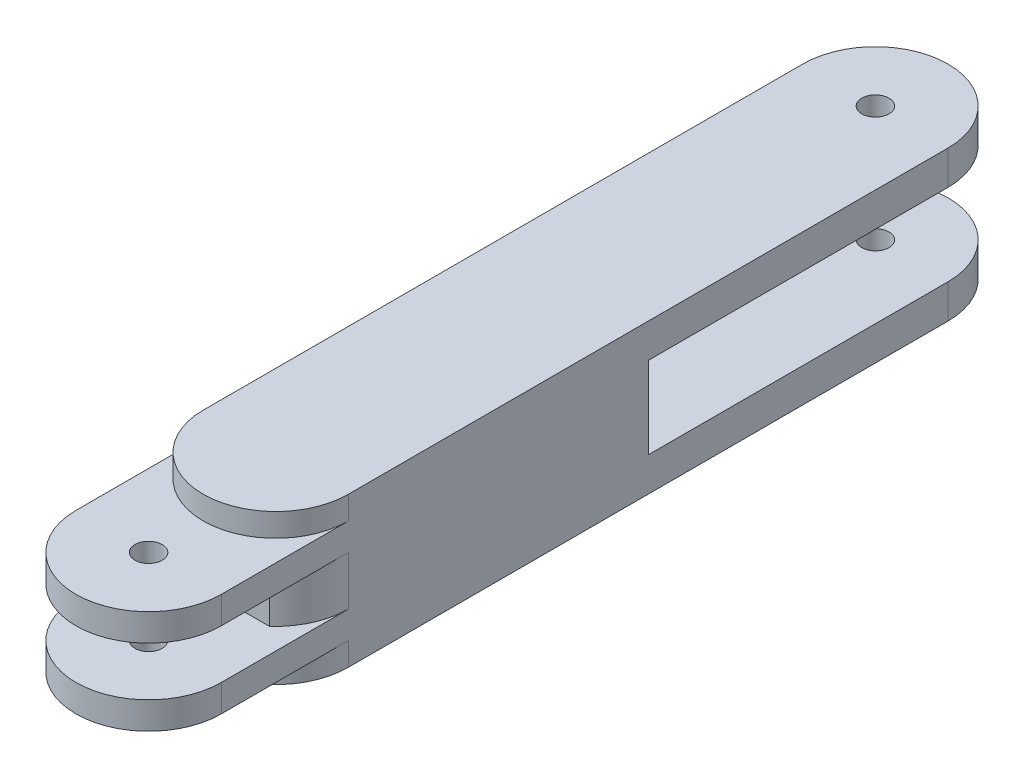
ISO-10303-21;
HEADER;
FILE_DESCRIPTION(('STEP AP214'),'2;1');
FILE_NAME('part.step','',(''),(''),'','','');
FILE_SCHEMA(('AUTOMOTIVE_DESIGN { 1 0 10303 214 1 1 1 1 }'));
ENDSEC;
DATA;
#1=APPLICATION_CONTEXT('core data for automotive mechanical design processes');
#2=APPLICATION_PROTOCOL_DEFINITION('international standard','automotive_design',2000,#1);
#3=PRODUCT_CONTEXT('',#1,'mechanical');
#4=PRODUCT('Part','Part','',(#3));
#5=PRODUCT_RELATED_PRODUCT_CATEGORY('part','',(#4));
#6=PRODUCT_DEFINITION_FORMATION('','',#4);
#7=PRODUCT_DEFINITION_CONTEXT('part definition',#1,'design');
#8=PRODUCT_DEFINITION('design','',#6,#7);
#9=PRODUCT_DEFINITION_SHAPE('','',#8);
#10=(LENGTH_UNIT() NAMED_UNIT(*) SI_UNIT(.MILLI.,.METRE.));
#11=(NAMED_UNIT(*) PLANE_ANGLE_UNIT() SI_UNIT($,.RADIAN.));
#12=(NAMED_UNIT(*) SI_UNIT($,.STERADIAN.) SOLID_ANGLE_UNIT());
#13=UNCERTAINTY_MEASURE_WITH_UNIT(LENGTH_MEASURE(1.E-05),#10,'distance_accuracy_value','');
#14=(GEOMETRIC_REPRESENTATION_CONTEXT(3) GLOBAL_UNCERTAINTY_ASSIGNED_CONTEXT((#13)) GLOBAL_UNIT_ASSIGNED_CONTEXT((#10,
#11,#12)) REPRESENTATION_CONTEXT('',''));
#15=CARTESIAN_POINT('',(0.,0.,0.));
#16=DIRECTION('',(0.,0.,1.));
#17=DIRECTION('',(1.,0.,0.));
#18=AXIS2_PLACEMENT_3D('',#15,#16,#17);
#19=CARTESIAN_POINT('',(425.80071629813,22.5,165.));
#20=DIRECTION('',(0.,0.,-1.));
#21=DIRECTION('',(-1.,0.,0.));
#22=AXIS2_PLACEMENT_3D('',#19,#20,#21);
#23=PLANE('',#22);
#24=DIRECTION('',(-1.,0.,0.));
#25=VECTOR('',#24,1.);
#26=CARTESIAN_POINT('',(425.80071629813,22.5,165.));
#27=LINE('',#26,#25);
#28=CARTESIAN_POINT('',(-30.,22.5,165.));
#29=VERTEX_POINT('',#28);
#30=CARTESIAN_POINT('',(-40.,22.5,165.));
#31=VERTEX_POINT('',#30);
#32=EDGE_CURVE('E394',#29,#31,#27,.T.);
#33=ORIENTED_EDGE('',*,*,#32,.F.);
#34=DIRECTION('',(0.,-1.,0.));
#35=VECTOR('',#34,1.);
#36=CARTESIAN_POINT('',(-30.,22.5,165.));
#37=LINE('',#36,#35);
#38=CARTESIAN_POINT('',(-30.,-22.5,165.));
#39=VERTEX_POINT('',#38);
#40=EDGE_CURVE('E63',#29,#39,#37,.T.);
#41=ORIENTED_EDGE('',*,*,#40,.T.);
#42=DIRECTION('',(-1.,0.,0.));
#43=VECTOR('',#42,1.);
#44=CARTESIAN_POINT('',(425.80071629813,-22.5,165.));
#45=LINE('',#44,#43);
#46=CARTESIAN_POINT('',(-40.,-22.5,165.));
#47=VERTEX_POINT('',#46);
#48=EDGE_CURVE('E390',#39,#47,#45,.T.);
#49=ORIENTED_EDGE('',*,*,#48,.T.);
#50=DIRECTION('',(0.,-1.,0.));
#51=VECTOR('',#50,1.);
#52=CARTESIAN_POINT('',(-40.,-41.25,165.));
#53=LINE('',#52,#51);
#54=EDGE_CURVE('E384',#31,#47,#53,.T.);
#55=ORIENTED_EDGE('',*,*,#54,.F.);
#56=EDGE_LOOP('',(#33,#41,#49,#55));
#57=FACE_BOUND('',#56,.T.);
#58=ADVANCED_FACE('F54',(#57),#23,.T.);
#59=CARTESIAN_POINT('',(0.,-41.25,330.));
#60=DIRECTION('',(0.,1.,0.));
#61=DIRECTION('',(0.,0.,1.));
#62=AXIS2_PLACEMENT_3D('',#59,#60,#61);
#63=CYLINDRICAL_SURFACE('',#62,40.);
#64=CARTESIAN_POINT('',(0.,28.5,330.));
#65=DIRECTION('',(0.,-1.,0.));
#66=DIRECTION('',(0.,0.,-1.));
#67=AXIS2_PLACEMENT_3D('',#64,#65,#66);
#68=CIRCLE('',#67,40.);
#69=CARTESIAN_POINT('',(40.,28.5,330.));
#70=VERTEX_POINT('',#69);
#71=CARTESIAN_POINT('',(-40.,28.5,330.));
#72=VERTEX_POINT('',#71);
#73=EDGE_CURVE('E343',#70,#72,#68,.T.);
#74=ORIENTED_EDGE('',*,*,#73,.F.);
#75=DIRECTION('',(0.,1.,0.));
#76=VECTOR('',#75,1.);
#77=CARTESIAN_POINT('',(40.,-41.25,330.));
#78=LINE('',#77,#76);
#79=CARTESIAN_POINT('',(40.,41.25,330.));
#80=VERTEX_POINT('',#79);
#81=EDGE_CURVE('E437',#70,#80,#78,.T.);
#82=ORIENTED_EDGE('',*,*,#81,.T.);
#83=CARTESIAN_POINT('',(0.,41.25,330.));
#84=DIRECTION('',(0.,-1.,0.));
#85=DIRECTION('',(1.,0.,0.));
#86=AXIS2_PLACEMENT_3D('',#83,#84,#85);
#87=CIRCLE('',#86,40.);
#88=CARTESIAN_POINT('',(-40.,41.25,330.));
#89=VERTEX_POINT('',#88);
#90=EDGE_CURVE('E420',#80,#89,#87,.T.);
#91=ORIENTED_EDGE('',*,*,#90,.T.);
#92=DIRECTION('',(0.,1.,0.));
#93=VECTOR('',#92,1.);
#94=CARTESIAN_POINT('',(-40.,-41.25,330.));
#95=LINE('',#94,#93);
#96=EDGE_CURVE('E433',#72,#89,#95,.T.);
#97=ORIENTED_EDGE('',*,*,#96,.F.);
#98=EDGE_LOOP('',(#74,#82,#91,#97));
#99=FACE_BOUND('',#98,.T.);
#100=ADVANCED_FACE('F514',(#99),#63,.T.);
#101=CARTESIAN_POINT('',(40.,-13.5,330.));
#102=VERTEX_POINT('',#101);
#103=CARTESIAN_POINT('',(40.,13.5,330.));
#104=VERTEX_POINT('',#103);
#105=EDGE_CURVE('E442',#102,#104,#78,.T.);
#106=ORIENTED_EDGE('',*,*,#105,.T.);
#107=CARTESIAN_POINT('',(0.,13.5,330.));
#108=DIRECTION('',(0.,-1.,0.));
#109=DIRECTION('',(0.,0.,-1.));
#110=AXIS2_PLACEMENT_3D('',#107,#108,#109);
#111=CIRCLE('',#110,40.);
#112=CARTESIAN_POINT('',(26.457513110646,13.5,360.));
#113=VERTEX_POINT('',#112);
#114=EDGE_CURVE('E342',#104,#113,#111,.T.);
#115=ORIENTED_EDGE('',*,*,#114,.T.);
#116=DIRECTION('',(0.,1.,0.));
#117=VECTOR('',#116,1.);
#118=CARTESIAN_POINT('',(26.4575131106459,-41.25,360.));
#119=LINE('',#118,#117);
#120=CARTESIAN_POINT('',(26.4575131106459,-13.5,360.));
#121=VERTEX_POINT('',#120);
#122=EDGE_CURVE('E451',#113,#121,#119,.F.);
#123=ORIENTED_EDGE('',*,*,#122,.T.);
#124=CARTESIAN_POINT('',(0.,-13.5,330.));
#125=DIRECTION('',(0.,1.,0.));
#126=DIRECTION('',(0.,0.,1.));
#127=AXIS2_PLACEMENT_3D('',#124,#125,#126);
#128=CIRCLE('',#127,40.);
#129=EDGE_CURVE('E371',#121,#102,#128,.T.);
#130=ORIENTED_EDGE('',*,*,#129,.T.);
#131=EDGE_LOOP('',(#106,#115,#123,#130));
#132=FACE_BOUND('',#131,.T.);
#133=ADVANCED_FACE('F517',(#132),#63,.T.);
#134=CARTESIAN_POINT('',(0.,-28.5,330.));
#135=DIRECTION('',(0.,1.,0.));
#136=DIRECTION('',(0.,0.,1.));
#137=AXIS2_PLACEMENT_3D('',#134,#135,#136);
#138=CIRCLE('',#137,40.);
#139=CARTESIAN_POINT('',(-40.,-28.5,330.));
#140=VERTEX_POINT('',#139);
#141=CARTESIAN_POINT('',(40.,-28.5,330.));
#142=VERTEX_POINT('',#141);
#143=EDGE_CURVE('E58',#140,#142,#138,.T.);
#144=ORIENTED_EDGE('',*,*,#143,.F.);
#145=CARTESIAN_POINT('',(-40.,-41.25,330.));
#146=VERTEX_POINT('',#145);
#147=EDGE_CURVE('E434',#146,#140,#95,.T.);
#148=ORIENTED_EDGE('',*,*,#147,.F.);
#149=CARTESIAN_POINT('',(0.,-41.25,330.));
#150=DIRECTION('',(0.,-1.,0.));
#151=DIRECTION('',(1.,0.,0.));
#152=AXIS2_PLACEMENT_3D('',#149,#150,#151);
#153=CIRCLE('',#152,40.);
#154=CARTESIAN_POINT('',(40.,-41.25,330.));
#155=VERTEX_POINT('',#154);
#156=EDGE_CURVE('E407',#155,#146,#153,.T.);
#157=ORIENTED_EDGE('',*,*,#156,.F.);
#158=EDGE_CURVE('E439',#155,#142,#78,.T.);
#159=ORIENTED_EDGE('',*,*,#158,.T.);
#160=EDGE_LOOP('',(#144,#148,#157,#159));
#161=FACE_BOUND('',#160,.T.);
#162=ADVANCED_FACE('F533',(#161),#63,.T.);
#163=DIRECTION('',(0.,1.,0.));
#164=VECTOR('',#163,1.);
#165=CARTESIAN_POINT('',(-26.4575131106459,-41.25,360.));
#166=LINE('',#165,#164);
#167=CARTESIAN_POINT('',(-26.457513110646,13.5,360.));
#168=VERTEX_POINT('',#167);
#169=CARTESIAN_POINT('',(-26.457513110646,-13.5,360.));
#170=VERTEX_POINT('',#169);
#171=EDGE_CURVE('E373',#168,#170,#166,.F.);
#172=ORIENTED_EDGE('',*,*,#171,.F.);
#173=CARTESIAN_POINT('',(-40.,13.5,330.));
#174=VERTEX_POINT('',#173);
#175=EDGE_CURVE('E340',#168,#174,#111,.T.);
#176=ORIENTED_EDGE('',*,*,#175,.T.);
#177=CARTESIAN_POINT('',(-40.,-13.5,330.));
#178=VERTEX_POINT('',#177);
#179=EDGE_CURVE('E438',#178,#174,#95,.T.);
#180=ORIENTED_EDGE('',*,*,#179,.F.);
#181=EDGE_CURVE('E370',#178,#170,#128,.T.);
#182=ORIENTED_EDGE('',*,*,#181,.T.);
#183=EDGE_LOOP('',(#172,#176,#180,#182));
#184=FACE_BOUND('',#183,.T.);
#185=ADVANCED_FACE('F553',(#184),#63,.T.);
#186=CARTESIAN_POINT('',(0.,-41.25,0.));
#187=DIRECTION('',(0.,1.,0.));
#188=DIRECTION('',(0.,0.,1.));
#189=AXIS2_PLACEMENT_3D('',#186,#187,#188);
#190=CYLINDRICAL_SURFACE('',#189,40.);
#191=CARTESIAN_POINT('',(0.,22.5,0.));
#192=DIRECTION('',(0.,-1.,0.));
#193=DIRECTION('',(0.,0.,-1.));
#194=AXIS2_PLACEMENT_3D('',#191,#192,#193);
#195=CIRCLE('',#194,40.);
#196=CARTESIAN_POINT('',(-40.,22.5,0.));
#197=VERTEX_POINT('',#196);
#198=CARTESIAN_POINT('',(40.,22.5,0.));
#199=VERTEX_POINT('',#198);
#200=EDGE_CURVE('E401',#197,#199,#195,.T.);
#201=ORIENTED_EDGE('',*,*,#200,.F.);
#202=DIRECTION('',(0.,1.,0.));
#203=VECTOR('',#202,1.);
#204=CARTESIAN_POINT('',(-40.,-41.25,0.));
#205=LINE('',#204,#203);
#206=CARTESIAN_POINT('',(-40.,41.25,0.));
#207=VERTEX_POINT('',#206);
#208=EDGE_CURVE('E412',#197,#207,#205,.T.);
#209=ORIENTED_EDGE('',*,*,#208,.T.);
#210=CARTESIAN_POINT('',(0.,41.25,0.));
#211=DIRECTION('',(0.,-1.,0.));
#212=DIRECTION('',(-1.,0.,0.));
#213=AXIS2_PLACEMENT_3D('',#210,#211,#212);
#214=CIRCLE('',#213,40.);
#215=CARTESIAN_POINT('',(40.,41.25,0.));
#216=VERTEX_POINT('',#215);
#217=EDGE_CURVE('E403',#207,#216,#214,.T.);
#218=ORIENTED_EDGE('',*,*,#217,.T.);
#219=DIRECTION('',(0.,1.,0.));
#220=VECTOR('',#219,1.);
#221=CARTESIAN_POINT('',(40.,-41.25,0.));
#222=LINE('',#221,#220);
#223=EDGE_CURVE('E441',#199,#216,#222,.T.);
#224=ORIENTED_EDGE('',*,*,#223,.F.);
#225=EDGE_LOOP('',(#201,#209,#218,#224));
#226=FACE_BOUND('',#225,.T.);
#227=ADVANCED_FACE('F503',(#226),#190,.T.);
#228=CARTESIAN_POINT('',(-40.,-41.25,0.));
#229=VERTEX_POINT('',#228);
#230=CARTESIAN_POINT('',(-40.,-22.5,0.));
#231=VERTEX_POINT('',#230);
#232=EDGE_CURVE('E430',#229,#231,#205,.T.);
#233=ORIENTED_EDGE('',*,*,#232,.T.);
#234=CARTESIAN_POINT('',(0.,-22.5,0.));
#235=DIRECTION('',(0.,1.,0.));
#236=DIRECTION('',(0.,0.,1.));
#237=AXIS2_PLACEMENT_3D('',#234,#235,#236);
#238=CIRCLE('',#237,40.);
#239=CARTESIAN_POINT('',(40.,-22.5,0.));
#240=VERTEX_POINT('',#239);
#241=EDGE_CURVE('E399',#240,#231,#238,.T.);
#242=ORIENTED_EDGE('',*,*,#241,.F.);
#243=CARTESIAN_POINT('',(40.,-41.25,0.));
#244=VERTEX_POINT('',#243);
#245=EDGE_CURVE('E443',#244,#240,#222,.T.);
#246=ORIENTED_EDGE('',*,*,#245,.F.);
#247=CARTESIAN_POINT('',(0.,-41.25,0.));
#248=DIRECTION('',(0.,-1.,0.));
#249=DIRECTION('',(-1.,0.,0.));
#250=AXIS2_PLACEMENT_3D('',#247,#248,#249);
#251=CIRCLE('',#250,40.);
#252=EDGE_CURVE('E408',#229,#244,#251,.T.);
#253=ORIENTED_EDGE('',*,*,#252,.F.);
#254=EDGE_LOOP('',(#233,#242,#246,#253));
#255=FACE_BOUND('',#254,.T.);
#256=ADVANCED_FACE('F56',(#255),#190,.T.);
#257=CARTESIAN_POINT('',(40.,-41.25,0.));
#258=DIRECTION('',(-1.,0.,0.));
#259=DIRECTION('',(0.,0.,1.));
#260=AXIS2_PLACEMENT_3D('',#257,#258,#259);
#261=PLANE('',#260);
#262=DIRECTION('',(0.,0.,1.));
#263=VECTOR('',#262,1.);
#264=CARTESIAN_POINT('',(40.,22.5,0.));
#265=LINE('',#264,#263);
#266=CARTESIAN_POINT('',(40.,22.5,165.));
#267=VERTEX_POINT('',#266);
#268=EDGE_CURVE('E450',#199,#267,#265,.T.);
#269=ORIENTED_EDGE('',*,*,#268,.F.);
#270=ORIENTED_EDGE('',*,*,#223,.T.);
#271=DIRECTION('',(0.,0.,1.));
#272=VECTOR('',#271,1.);
#273=CARTESIAN_POINT('',(40.,41.25,0.));
#274=LINE('',#273,#272);
#275=EDGE_CURVE('E416',#216,#80,#274,.T.);
#276=ORIENTED_EDGE('',*,*,#275,.T.);
#277=ORIENTED_EDGE('',*,*,#81,.F.);
#278=DIRECTION('',(0.,0.,1.));
#279=VECTOR('',#278,1.);
#280=CARTESIAN_POINT('',(40.,28.5,330.));
#281=LINE('',#280,#279);
#282=CARTESIAN_POINT('',(40.,28.5,400.));
#283=VERTEX_POINT('',#282);
#284=EDGE_CURVE('E322',#70,#283,#281,.T.);
#285=ORIENTED_EDGE('',*,*,#284,.T.);
#286=DIRECTION('',(0.,-1.,0.));
#287=VECTOR('',#286,1.);
#288=CARTESIAN_POINT('',(40.,28.5,400.));
#289=LINE('',#288,#287);
#290=CARTESIAN_POINT('',(40.,13.5,400.));
#291=VERTEX_POINT('',#290);
#292=EDGE_CURVE('E326',#283,#291,#289,.T.);
#293=ORIENTED_EDGE('',*,*,#292,.T.);
#294=DIRECTION('',(0.,0.,1.));
#295=VECTOR('',#294,1.);
#296=CARTESIAN_POINT('',(40.,13.5,330.));
#297=LINE('',#296,#295);
#298=EDGE_CURVE('E329',#104,#291,#297,.T.);
#299=ORIENTED_EDGE('',*,*,#298,.F.);
#300=ORIENTED_EDGE('',*,*,#105,.F.);
#301=DIRECTION('',(0.,0.,-1.));
#302=VECTOR('',#301,1.);
#303=CARTESIAN_POINT('',(40.,-13.5,330.));
#304=LINE('',#303,#302);
#305=CARTESIAN_POINT('',(40.,-13.5,400.));
#306=VERTEX_POINT('',#305);
#307=EDGE_CURVE('E356',#306,#102,#304,.T.);
#308=ORIENTED_EDGE('',*,*,#307,.F.);
#309=DIRECTION('',(0.,1.,0.));
#310=VECTOR('',#309,1.);
#311=CARTESIAN_POINT('',(40.,-28.5,400.));
#312=LINE('',#311,#310);
#313=CARTESIAN_POINT('',(40.,-28.5,400.));
#314=VERTEX_POINT('',#313);
#315=EDGE_CURVE('E353',#314,#306,#312,.T.);
#316=ORIENTED_EDGE('',*,*,#315,.F.);
#317=DIRECTION('',(0.,0.,-1.));
#318=VECTOR('',#317,1.);
#319=CARTESIAN_POINT('',(40.,-28.5,330.));
#320=LINE('',#319,#318);
#321=EDGE_CURVE('E349',#314,#142,#320,.T.);
#322=ORIENTED_EDGE('',*,*,#321,.T.);
#323=ORIENTED_EDGE('',*,*,#158,.F.);
#324=DIRECTION('',(0.,0.,1.));
#325=VECTOR('',#324,1.);
#326=CARTESIAN_POINT('',(40.,-41.25,0.));
#327=LINE('',#326,#325);
#328=EDGE_CURVE('E405',#244,#155,#327,.T.);
#329=ORIENTED_EDGE('',*,*,#328,.F.);
#330=ORIENTED_EDGE('',*,*,#245,.T.);
#331=DIRECTION('',(0.,0.,-1.));
#332=VECTOR('',#331,1.);
#333=CARTESIAN_POINT('',(40.,-22.5,0.));
#334=LINE('',#333,#332);
#335=CARTESIAN_POINT('',(40.,-22.5,165.));
#336=VERTEX_POINT('',#335);
#337=EDGE_CURVE('E446',#336,#240,#334,.T.);
#338=ORIENTED_EDGE('',*,*,#337,.F.);
#339=DIRECTION('',(0.,-1.,0.));
#340=VECTOR('',#339,1.);
#341=CARTESIAN_POINT('',(40.,-41.25,165.));
#342=LINE('',#341,#340);
#343=EDGE_CURVE('E448',#267,#336,#342,.T.);
#344=ORIENTED_EDGE('',*,*,#343,.F.);
#345=EDGE_LOOP('',(#269,#270,#276,#277,#285,#293,#299,#300,#308,#316,#322,#323,#329,#330,#338,#344));
#346=FACE_BOUND('',#345,.T.);
#347=ADVANCED_FACE('F488',(#346),#261,.F.);
#348=CARTESIAN_POINT('',(-40.,-41.25,0.));
#349=DIRECTION('',(1.,0.,0.));
#350=DIRECTION('',(0.,0.,-1.));
#351=AXIS2_PLACEMENT_3D('',#348,#349,#350);
#352=PLANE('',#351);
#353=ORIENTED_EDGE('',*,*,#208,.F.);
#354=DIRECTION('',(0.,0.,1.));
#355=VECTOR('',#354,1.);
#356=CARTESIAN_POINT('',(-40.,22.5,0.));
#357=LINE('',#356,#355);
#358=EDGE_CURVE('E387',#197,#31,#357,.T.);
#359=ORIENTED_EDGE('',*,*,#358,.T.);
#360=ORIENTED_EDGE('',*,*,#54,.T.);
#361=DIRECTION('',(0.,0.,-1.));
#362=VECTOR('',#361,1.);
#363=CARTESIAN_POINT('',(-40.,-22.5,0.));
#364=LINE('',#363,#362);
#365=EDGE_CURVE('E381',#47,#231,#364,.T.);
#366=ORIENTED_EDGE('',*,*,#365,.T.);
#367=ORIENTED_EDGE('',*,*,#232,.F.);
#368=DIRECTION('',(0.,0.,-1.));
#369=VECTOR('',#368,1.);
#370=CARTESIAN_POINT('',(-40.,-41.25,0.));
#371=LINE('',#370,#369);
#372=EDGE_CURVE('E410',#146,#229,#371,.T.);
#373=ORIENTED_EDGE('',*,*,#372,.F.);
#374=ORIENTED_EDGE('',*,*,#147,.T.);
#375=DIRECTION('',(0.,0.,1.));
#376=VECTOR('',#375,1.);
#377=CARTESIAN_POINT('',(-40.,-28.5,330.));
#378=LINE('',#377,#376);
#379=CARTESIAN_POINT('',(-40.,-28.5,400.));
#380=VERTEX_POINT('',#379);
#381=EDGE_CURVE('E350',#140,#380,#378,.T.);
#382=ORIENTED_EDGE('',*,*,#381,.T.);
#383=DIRECTION('',(0.,1.,0.));
#384=VECTOR('',#383,1.);
#385=CARTESIAN_POINT('',(-40.,-28.5,400.));
#386=LINE('',#385,#384);
#387=CARTESIAN_POINT('',(-40.,-13.5,400.));
#388=VERTEX_POINT('',#387);
#389=EDGE_CURVE('E368',#380,#388,#386,.T.);
#390=ORIENTED_EDGE('',*,*,#389,.T.);
#391=DIRECTION('',(0.,0.,1.));
#392=VECTOR('',#391,1.);
#393=CARTESIAN_POINT('',(-40.,-13.5,330.));
#394=LINE('',#393,#392);
#395=EDGE_CURVE('E345',#178,#388,#394,.T.);
#396=ORIENTED_EDGE('',*,*,#395,.F.);
#397=ORIENTED_EDGE('',*,*,#179,.T.);
#398=DIRECTION('',(0.,0.,-1.));
#399=VECTOR('',#398,1.);
#400=CARTESIAN_POINT('',(-40.,13.5,400.));
#401=LINE('',#400,#399);
#402=CARTESIAN_POINT('',(-40.,13.5,400.));
#403=VERTEX_POINT('',#402);
#404=EDGE_CURVE('E81',#403,#174,#401,.T.);
#405=ORIENTED_EDGE('',*,*,#404,.F.);
#406=DIRECTION('',(0.,-1.,0.));
#407=VECTOR('',#406,1.);
#408=CARTESIAN_POINT('',(-40.,28.5,400.));
#409=LINE('',#408,#407);
#410=CARTESIAN_POINT('',(-40.,28.5,400.));
#411=VERTEX_POINT('',#410);
#412=EDGE_CURVE('E338',#411,#403,#409,.T.);
#413=ORIENTED_EDGE('',*,*,#412,.F.);
#414=DIRECTION('',(0.,0.,-1.));
#415=VECTOR('',#414,1.);
#416=CARTESIAN_POINT('',(-40.,28.5,400.));
#417=LINE('',#416,#415);
#418=EDGE_CURVE('E319',#411,#72,#417,.T.);
#419=ORIENTED_EDGE('',*,*,#418,.T.);
#420=ORIENTED_EDGE('',*,*,#96,.T.);
#421=DIRECTION('',(0.,0.,-1.));
#422=VECTOR('',#421,1.);
#423=CARTESIAN_POINT('',(-40.,41.25,0.));
#424=LINE('',#423,#422);
#425=EDGE_CURVE('E415',#89,#207,#424,.T.);
#426=ORIENTED_EDGE('',*,*,#425,.T.);
#427=EDGE_LOOP('',(#353,#359,#360,#366,#367,#373,#374,#382,#390,#396,#397,#405,#413,#419,#420,#426));
#428=FACE_BOUND('',#427,.T.);
#429=ADVANCED_FACE('F501',(#428),#352,.F.);
#430=CARTESIAN_POINT('',(0.,-41.25,0.));
#431=DIRECTION('',(0.,-1.,0.));
#432=DIRECTION('',(0.,0.,-1.));
#433=AXIS2_PLACEMENT_3D('',#430,#431,#432);
#434=PLANE('',#433);
#435=CARTESIAN_POINT('',(0.,-41.25,0.));
#436=DIRECTION('',(0.,1.,0.));
#437=DIRECTION('',(0.,0.,-1.));
#438=AXIS2_PLACEMENT_3D('',#435,#436,#437);
#439=CIRCLE('',#438,7.5);
#440=CARTESIAN_POINT('',(0.,-41.25,-7.5));
#441=VERTEX_POINT('',#440);
#442=EDGE_CURVE('E293',#441,#441,#439,.T.);
#443=ORIENTED_EDGE('',*,*,#442,.T.);
#444=EDGE_LOOP('',(#443));
#445=FACE_BOUND('',#444,.T.);
#446=ORIENTED_EDGE('',*,*,#252,.T.);
#447=ORIENTED_EDGE('',*,*,#328,.T.);
#448=ORIENTED_EDGE('',*,*,#156,.T.);
#449=ORIENTED_EDGE('',*,*,#372,.T.);
#450=EDGE_LOOP('',(#446,#447,#448,#449));
#451=FACE_BOUND('',#450,.T.);
#452=ADVANCED_FACE('F535',(#445,#451),#434,.T.);
#453=CARTESIAN_POINT('',(0.,41.25,0.));
#454=DIRECTION('',(0.,-1.,0.));
#455=DIRECTION('',(0.,0.,-1.));
#456=AXIS2_PLACEMENT_3D('',#453,#454,#455);
#457=PLANE('',#456);
#458=CARTESIAN_POINT('',(0.,41.25,0.));
#459=DIRECTION('',(0.,-1.,0.));
#460=DIRECTION('',(0.,0.,-1.));
#461=AXIS2_PLACEMENT_3D('',#458,#459,#460);
#462=CIRCLE('',#461,7.5);
#463=CARTESIAN_POINT('',(0.,41.25,-7.5));
#464=VERTEX_POINT('',#463);
#465=EDGE_CURVE('E300',#464,#464,#462,.F.);
#466=ORIENTED_EDGE('',*,*,#465,.F.);
#467=EDGE_LOOP('',(#466));
#468=FACE_BOUND('',#467,.T.);
#469=ORIENTED_EDGE('',*,*,#217,.F.);
#470=ORIENTED_EDGE('',*,*,#425,.F.);
#471=ORIENTED_EDGE('',*,*,#90,.F.);
#472=ORIENTED_EDGE('',*,*,#275,.F.);
#473=EDGE_LOOP('',(#469,#470,#471,#472));
#474=FACE_BOUND('',#473,.T.);
#475=ADVANCED_FACE('F509',(#468,#474),#457,.F.);
#476=CARTESIAN_POINT('',(425.80071629813,22.5,-40.));
#477=DIRECTION('',(0.,-1.,0.));
#478=DIRECTION('',(0.,0.,-1.));
#479=AXIS2_PLACEMENT_3D('',#476,#477,#478);
#480=PLANE('',#479);
#481=CARTESIAN_POINT('',(0.,22.5,0.));
#482=DIRECTION('',(0.,-1.,0.));
#483=DIRECTION('',(0.,0.,-1.));
#484=AXIS2_PLACEMENT_3D('',#481,#482,#483);
#485=CIRCLE('',#484,7.5);
#486=CARTESIAN_POINT('',(0.,22.5,-7.5));
#487=VERTEX_POINT('',#486);
#488=EDGE_CURVE('E297',#487,#487,#485,.F.);
#489=ORIENTED_EDGE('',*,*,#488,.T.);
#490=EDGE_LOOP('',(#489));
#491=FACE_BOUND('',#490,.T.);
#492=ORIENTED_EDGE('',*,*,#200,.T.);
#493=ORIENTED_EDGE('',*,*,#268,.T.);
#494=CARTESIAN_POINT('',(30.,22.5,165.));
#495=VERTEX_POINT('',#494);
#496=EDGE_CURVE('E396',#267,#495,#27,.T.);
#497=ORIENTED_EDGE('',*,*,#496,.T.);
#498=EDGE_CURVE('E400',#495,#29,#27,.T.);
#499=ORIENTED_EDGE('',*,*,#498,.T.);
#500=ORIENTED_EDGE('',*,*,#32,.T.);
#501=ORIENTED_EDGE('',*,*,#358,.F.);
#502=EDGE_LOOP('',(#492,#493,#497,#499,#500,#501));
#503=FACE_BOUND('',#502,.T.);
#504=ADVANCED_FACE('F478',(#491,#503),#480,.T.);
#505=DIRECTION('',(0.,-1.,0.));
#506=VECTOR('',#505,1.);
#507=CARTESIAN_POINT('',(30.,-41.25,165.));
#508=LINE('',#507,#506);
#509=CARTESIAN_POINT('',(30.,-22.5,165.));
#510=VERTEX_POINT('',#509);
#511=EDGE_CURVE('E11',#495,#510,#508,.T.);
#512=ORIENTED_EDGE('',*,*,#511,.F.);
#513=ORIENTED_EDGE('',*,*,#496,.F.);
#514=ORIENTED_EDGE('',*,*,#343,.T.);
#515=EDGE_CURVE('E391',#336,#510,#45,.T.);
#516=ORIENTED_EDGE('',*,*,#515,.T.);
#517=EDGE_LOOP('',(#512,#513,#514,#516));
#518=FACE_BOUND('',#517,.T.);
#519=ADVANCED_FACE('F484',(#518),#23,.T.);
#520=CARTESIAN_POINT('',(425.80071629813,-22.5,165.));
#521=DIRECTION('',(0.,1.,0.));
#522=DIRECTION('',(0.,0.,1.));
#523=AXIS2_PLACEMENT_3D('',#520,#521,#522);
#524=PLANE('',#523);
#525=CARTESIAN_POINT('',(0.,-22.5,0.));
#526=DIRECTION('',(0.,1.,0.));
#527=DIRECTION('',(0.,0.,1.));
#528=AXIS2_PLACEMENT_3D('',#525,#526,#527);
#529=CIRCLE('',#528,7.5);
#530=CARTESIAN_POINT('',(0.,-22.5,7.5));
#531=VERTEX_POINT('',#530);
#532=EDGE_CURVE('E296',#531,#531,#529,.F.);
#533=ORIENTED_EDGE('',*,*,#532,.T.);
#534=EDGE_LOOP('',(#533));
#535=FACE_BOUND('',#534,.T.);
#536=ORIENTED_EDGE('',*,*,#241,.T.);
#537=ORIENTED_EDGE('',*,*,#365,.F.);
#538=ORIENTED_EDGE('',*,*,#48,.F.);
#539=EDGE_CURVE('E395',#510,#39,#45,.T.);
#540=ORIENTED_EDGE('',*,*,#539,.F.);
#541=ORIENTED_EDGE('',*,*,#515,.F.);
#542=ORIENTED_EDGE('',*,*,#337,.T.);
#543=EDGE_LOOP('',(#536,#537,#538,#540,#541,#542));
#544=FACE_BOUND('',#543,.T.);
#545=ADVANCED_FACE('F493',(#535,#544),#524,.T.);
#546=CARTESIAN_POINT('',(425.80071629813,-13.5,360.));
#547=DIRECTION('',(0.,-1.,0.));
#548=DIRECTION('',(0.,0.,-1.));
#549=AXIS2_PLACEMENT_3D('',#546,#547,#548);
#550=PLANE('',#549);
#551=CARTESIAN_POINT('',(0.,-13.5,400.));
#552=DIRECTION('',(0.,-1.,0.));
#553=DIRECTION('',(0.,0.,-1.));
#554=AXIS2_PLACEMENT_3D('',#551,#552,#553);
#555=CIRCLE('',#554,7.5);
#556=CARTESIAN_POINT('',(0.,-13.5,392.5));
#557=VERTEX_POINT('',#556);
#558=EDGE_CURVE('E313',#557,#557,#555,.F.);
#559=ORIENTED_EDGE('',*,*,#558,.F.);
#560=EDGE_LOOP('',(#559));
#561=FACE_BOUND('',#560,.T.);
#562=DIRECTION('',(-1.,0.,0.));
#563=VECTOR('',#562,1.);
#564=CARTESIAN_POINT('',(425.80071629813,-13.5,360.));
#565=LINE('',#564,#563);
#566=EDGE_CURVE('E378',#121,#170,#565,.T.);
#567=ORIENTED_EDGE('',*,*,#566,.T.);
#568=ORIENTED_EDGE('',*,*,#181,.F.);
#569=ORIENTED_EDGE('',*,*,#395,.T.);
#570=CARTESIAN_POINT('',(0.,-13.5,400.));
#571=DIRECTION('',(0.,1.,0.));
#572=DIRECTION('',(-1.,0.,0.));
#573=AXIS2_PLACEMENT_3D('',#570,#571,#572);
#574=CIRCLE('',#573,40.);
#575=EDGE_CURVE('E357',#388,#306,#574,.T.);
#576=ORIENTED_EDGE('',*,*,#575,.T.);
#577=ORIENTED_EDGE('',*,*,#307,.T.);
#578=ORIENTED_EDGE('',*,*,#129,.F.);
#579=EDGE_LOOP('',(#567,#568,#569,#576,#577,#578));
#580=FACE_BOUND('',#579,.T.);
#581=ADVANCED_FACE('F521',(#561,#580),#550,.F.);
#582=CARTESIAN_POINT('',(425.80071629813,13.5,370.));
#583=DIRECTION('',(0.,1.,0.));
#584=DIRECTION('',(0.,0.,1.));
#585=AXIS2_PLACEMENT_3D('',#582,#583,#584);
#586=PLANE('',#585);
#587=CARTESIAN_POINT('',(0.,13.5,400.));
#588=DIRECTION('',(0.,1.,0.));
#589=DIRECTION('',(0.,0.,1.));
#590=AXIS2_PLACEMENT_3D('',#587,#588,#589);
#591=CIRCLE('',#590,7.5);
#592=CARTESIAN_POINT('',(0.,13.5,407.5));
#593=VERTEX_POINT('',#592);
#594=EDGE_CURVE('E310',#593,#593,#591,.F.);
#595=ORIENTED_EDGE('',*,*,#594,.F.);
#596=EDGE_LOOP('',(#595));
#597=FACE_BOUND('',#596,.T.);
#598=DIRECTION('',(-1.,0.,0.));
#599=VECTOR('',#598,1.);
#600=CARTESIAN_POINT('',(425.80071629813,13.5,360.));
#601=LINE('',#600,#599);
#602=EDGE_CURVE('E375',#113,#168,#601,.T.);
#603=ORIENTED_EDGE('',*,*,#602,.F.);
#604=ORIENTED_EDGE('',*,*,#114,.F.);
#605=ORIENTED_EDGE('',*,*,#298,.T.);
#606=CARTESIAN_POINT('',(0.,13.5,400.));
#607=DIRECTION('',(0.,-1.,0.));
#608=DIRECTION('',(1.,0.,0.));
#609=AXIS2_PLACEMENT_3D('',#606,#607,#608);
#610=CIRCLE('',#609,40.);
#611=EDGE_CURVE('E316',#291,#403,#610,.T.);
#612=ORIENTED_EDGE('',*,*,#611,.T.);
#613=ORIENTED_EDGE('',*,*,#404,.T.);
#614=ORIENTED_EDGE('',*,*,#175,.F.);
#615=EDGE_LOOP('',(#603,#604,#605,#612,#613,#614));
#616=FACE_BOUND('',#615,.T.);
#617=ADVANCED_FACE('F600',(#597,#616),#586,.F.);
#618=CARTESIAN_POINT('',(425.80071629813,13.5,360.));
#619=DIRECTION('',(0.,0.,-1.));
#620=DIRECTION('',(-1.,0.,0.));
#621=AXIS2_PLACEMENT_3D('',#618,#619,#620);
#622=PLANE('',#621);
#623=ORIENTED_EDGE('',*,*,#602,.T.);
#624=ORIENTED_EDGE('',*,*,#171,.T.);
#625=ORIENTED_EDGE('',*,*,#566,.F.);
#626=ORIENTED_EDGE('',*,*,#122,.F.);
#627=EDGE_LOOP('',(#623,#624,#625,#626));
#628=FACE_BOUND('',#627,.T.);
#629=ADVANCED_FACE('F599',(#628),#622,.F.);
#630=CARTESIAN_POINT('',(0.,-28.5,400.));
#631=DIRECTION('',(0.,1.,0.));
#632=DIRECTION('',(0.,0.,1.));
#633=AXIS2_PLACEMENT_3D('',#630,#631,#632);
#634=CYLINDRICAL_SURFACE('',#633,40.);
#635=ORIENTED_EDGE('',*,*,#575,.F.);
#636=ORIENTED_EDGE('',*,*,#389,.F.);
#637=CARTESIAN_POINT('',(0.,-28.5,400.));
#638=DIRECTION('',(0.,1.,0.));
#639=DIRECTION('',(-1.,0.,0.));
#640=AXIS2_PLACEMENT_3D('',#637,#638,#639);
#641=CIRCLE('',#640,40.);
#642=EDGE_CURVE('E346',#380,#314,#641,.T.);
#643=ORIENTED_EDGE('',*,*,#642,.T.);
#644=ORIENTED_EDGE('',*,*,#315,.T.);
#645=EDGE_LOOP('',(#635,#636,#643,#644));
#646=FACE_BOUND('',#645,.T.);
#647=ADVANCED_FACE('F526',(#646),#634,.T.);
#648=CARTESIAN_POINT('',(0.,-28.5,400.));
#649=DIRECTION('',(0.,1.,0.));
#650=DIRECTION('',(0.,0.,1.));
#651=AXIS2_PLACEMENT_3D('',#648,#649,#650);
#652=PLANE('',#651);
#653=CARTESIAN_POINT('',(0.,-28.5,400.));
#654=DIRECTION('',(0.,1.,0.));
#655=DIRECTION('',(0.,0.,1.));
#656=AXIS2_PLACEMENT_3D('',#653,#654,#655);
#657=CIRCLE('',#656,7.5);
#658=CARTESIAN_POINT('',(0.,-28.5,407.5));
#659=VERTEX_POINT('',#658);
#660=EDGE_CURVE('E303',#659,#659,#657,.T.);
#661=ORIENTED_EDGE('',*,*,#660,.T.);
#662=EDGE_LOOP('',(#661));
#663=FACE_BOUND('',#662,.T.);
#664=ORIENTED_EDGE('',*,*,#381,.F.);
#665=ORIENTED_EDGE('',*,*,#143,.T.);
#666=ORIENTED_EDGE('',*,*,#321,.F.);
#667=ORIENTED_EDGE('',*,*,#642,.F.);
#668=EDGE_LOOP('',(#664,#665,#666,#667));
#669=FACE_BOUND('',#668,.T.);
#670=ADVANCED_FACE('F530',(#663,#669),#652,.F.);
#671=CARTESIAN_POINT('',(0.,28.5,400.));
#672=DIRECTION('',(0.,-1.,0.));
#673=DIRECTION('',(0.,0.,-1.));
#674=AXIS2_PLACEMENT_3D('',#671,#672,#673);
#675=PLANE('',#674);
#676=CARTESIAN_POINT('',(0.,28.5,400.));
#677=DIRECTION('',(0.,-1.,0.));
#678=DIRECTION('',(0.,0.,-1.));
#679=AXIS2_PLACEMENT_3D('',#676,#677,#678);
#680=CIRCLE('',#679,7.5);
#681=CARTESIAN_POINT('',(0.,28.5,392.5));
#682=VERTEX_POINT('',#681);
#683=EDGE_CURVE('E309',#682,#682,#680,.F.);
#684=ORIENTED_EDGE('',*,*,#683,.F.);
#685=EDGE_LOOP('',(#684));
#686=FACE_BOUND('',#685,.T.);
#687=ORIENTED_EDGE('',*,*,#284,.F.);
#688=ORIENTED_EDGE('',*,*,#73,.T.);
#689=ORIENTED_EDGE('',*,*,#418,.F.);
#690=CARTESIAN_POINT('',(0.,28.5,400.));
#691=DIRECTION('',(0.,-1.,0.));
#692=DIRECTION('',(1.,0.,0.));
#693=AXIS2_PLACEMENT_3D('',#690,#691,#692);
#694=CIRCLE('',#693,40.);
#695=EDGE_CURVE('E323',#283,#411,#694,.T.);
#696=ORIENTED_EDGE('',*,*,#695,.F.);
#697=EDGE_LOOP('',(#687,#688,#689,#696));
#698=FACE_BOUND('',#697,.T.);
#699=ADVANCED_FACE('F587',(#686,#698),#675,.F.);
#700=CARTESIAN_POINT('',(0.,28.5,400.));
#701=DIRECTION('',(0.,-1.,0.));
#702=DIRECTION('',(0.,0.,-1.));
#703=AXIS2_PLACEMENT_3D('',#700,#701,#702);
#704=CYLINDRICAL_SURFACE('',#703,40.);
#705=ORIENTED_EDGE('',*,*,#611,.F.);
#706=ORIENTED_EDGE('',*,*,#292,.F.);
#707=ORIENTED_EDGE('',*,*,#695,.T.);
#708=ORIENTED_EDGE('',*,*,#412,.T.);
#709=EDGE_LOOP('',(#705,#706,#707,#708));
#710=FACE_BOUND('',#709,.T.);
#711=ADVANCED_FACE('F585',(#710),#704,.T.);
#712=CARTESIAN_POINT('',(0.,465.064838699031,400.));
#713=DIRECTION('',(0.,-1.,0.));
#714=DIRECTION('',(0.,0.,-1.));
#715=AXIS2_PLACEMENT_3D('',#712,#713,#714);
#716=CYLINDRICAL_SURFACE('',#715,7.5);
#717=ORIENTED_EDGE('',*,*,#594,.T.);
#718=EDGE_LOOP('',(#717));
#719=FACE_BOUND('',#718,.T.);
#720=ORIENTED_EDGE('',*,*,#683,.T.);
#721=EDGE_LOOP('',(#720));
#722=FACE_BOUND('',#721,.T.);
#723=ADVANCED_FACE('F582',(#719,#722),#716,.F.);
#724=ORIENTED_EDGE('',*,*,#558,.T.);
#725=EDGE_LOOP('',(#724));
#726=FACE_BOUND('',#725,.T.);
#727=ORIENTED_EDGE('',*,*,#660,.F.);
#728=EDGE_LOOP('',(#727));
#729=FACE_BOUND('',#728,.T.);
#730=ADVANCED_FACE('F576',(#726,#729),#716,.F.);
#731=CARTESIAN_POINT('',(0.,452.314838699031,0.));
#732=DIRECTION('',(0.,-1.,0.));
#733=DIRECTION('',(0.,0.,-1.));
#734=AXIS2_PLACEMENT_3D('',#731,#732,#733);
#735=CYLINDRICAL_SURFACE('',#734,7.5);
#736=ORIENTED_EDGE('',*,*,#442,.F.);
#737=EDGE_LOOP('',(#736));
#738=FACE_BOUND('',#737,.T.);
#739=ORIENTED_EDGE('',*,*,#532,.F.);
#740=EDGE_LOOP('',(#739));
#741=FACE_BOUND('',#740,.T.);
#742=ADVANCED_FACE('F568',(#738,#741),#735,.F.);
#743=ORIENTED_EDGE('',*,*,#465,.T.);
#744=EDGE_LOOP('',(#743));
#745=FACE_BOUND('',#744,.T.);
#746=ORIENTED_EDGE('',*,*,#488,.F.);
#747=EDGE_LOOP('',(#746));
#748=FACE_BOUND('',#747,.T.);
#749=ADVANCED_FACE('F566',(#745,#748),#735,.F.);
#750=CARTESIAN_POINT('',(425.80071629813,22.5,165.));
#751=DIRECTION('',(0.,0.,-1.));
#752=DIRECTION('',(-1.,0.,0.));
#753=AXIS2_PLACEMENT_3D('',#750,#751,#752);
#754=PLANE('',#753);
#755=CARTESIAN_POINT('',(30.,31.25,165.));
#756=VERTEX_POINT('',#755);
#757=EDGE_CURVE('E65',#756,#495,#508,.T.);
#758=ORIENTED_EDGE('',*,*,#757,.F.);
#759=DIRECTION('',(-1.,0.,0.));
#760=VECTOR('',#759,1.);
#761=CARTESIAN_POINT('',(425.80071629813,31.25,165.));
#762=LINE('',#761,#760);
#763=CARTESIAN_POINT('',(-30.,31.25,165.));
#764=VERTEX_POINT('',#763);
#765=EDGE_CURVE('E252',#756,#764,#762,.T.);
#766=ORIENTED_EDGE('',*,*,#765,.T.);
#767=EDGE_CURVE('E254',#764,#29,#37,.T.);
#768=ORIENTED_EDGE('',*,*,#767,.T.);
#769=ORIENTED_EDGE('',*,*,#498,.F.);
#770=EDGE_LOOP('',(#758,#766,#768,#769));
#771=FACE_BOUND('',#770,.T.);
#772=ADVANCED_FACE('F473',(#771),#754,.F.);
#773=CARTESIAN_POINT('',(0.,-41.25,330.));
#774=DIRECTION('',(0.,1.,0.));
#775=DIRECTION('',(0.,0.,1.));
#776=AXIS2_PLACEMENT_3D('',#773,#774,#775);
#777=CYLINDRICAL_SURFACE('',#776,30.);
#778=CARTESIAN_POINT('',(0.,-23.5,330.));
#779=DIRECTION('',(0.,-1.,0.));
#780=DIRECTION('',(0.,0.,-1.));
#781=AXIS2_PLACEMENT_3D('',#778,#779,#780);
#782=CIRCLE('',#781,30.);
#783=CARTESIAN_POINT('',(-22.3606797749979,-23.5,350.));
#784=VERTEX_POINT('',#783);
#785=CARTESIAN_POINT('',(22.3606797749979,-23.5,350.));
#786=VERTEX_POINT('',#785);
#787=EDGE_CURVE('E288',#784,#786,#782,.F.);
#788=ORIENTED_EDGE('',*,*,#787,.T.);
#789=DIRECTION('',(0.,1.,0.));
#790=VECTOR('',#789,1.);
#791=CARTESIAN_POINT('',(22.3606797749979,23.5,350.));
#792=LINE('',#791,#790);
#793=CARTESIAN_POINT('',(22.3606797749979,23.5,350.));
#794=VERTEX_POINT('',#793);
#795=EDGE_CURVE('E268',#794,#786,#792,.F.);
#796=ORIENTED_EDGE('',*,*,#795,.F.);
#797=CARTESIAN_POINT('',(0.,23.5,330.));
#798=DIRECTION('',(0.,1.,0.));
#799=DIRECTION('',(0.,0.,1.));
#800=AXIS2_PLACEMENT_3D('',#797,#798,#799);
#801=CIRCLE('',#800,30.);
#802=CARTESIAN_POINT('',(-22.3606797749979,23.5,350.));
#803=VERTEX_POINT('',#802);
#804=EDGE_CURVE('E291',#794,#803,#801,.F.);
#805=ORIENTED_EDGE('',*,*,#804,.T.);
#806=DIRECTION('',(0.,1.,0.));
#807=VECTOR('',#806,1.);
#808=CARTESIAN_POINT('',(-22.3606797749979,23.5,350.));
#809=LINE('',#808,#807);
#810=EDGE_CURVE('E275',#803,#784,#809,.F.);
#811=ORIENTED_EDGE('',*,*,#810,.T.);
#812=EDGE_LOOP('',(#788,#796,#805,#811));
#813=FACE_BOUND('',#812,.T.);
#814=CARTESIAN_POINT('',(0.,31.25,330.));
#815=DIRECTION('',(0.,-1.,0.));
#816=DIRECTION('',(0.,0.,-1.));
#817=AXIS2_PLACEMENT_3D('',#814,#815,#816);
#818=CIRCLE('',#817,30.);
#819=CARTESIAN_POINT('',(30.,31.25,330.));
#820=VERTEX_POINT('',#819);
#821=CARTESIAN_POINT('',(-30.,31.25,330.));
#822=VERTEX_POINT('',#821);
#823=EDGE_CURVE('E250',#820,#822,#818,.T.);
#824=ORIENTED_EDGE('',*,*,#823,.F.);
#825=DIRECTION('',(0.,1.,0.));
#826=VECTOR('',#825,1.);
#827=CARTESIAN_POINT('',(30.,-41.25,330.));
#828=LINE('',#827,#826);
#829=CARTESIAN_POINT('',(30.,-31.25,330.));
#830=VERTEX_POINT('',#829);
#831=EDGE_CURVE('E232',#830,#820,#828,.T.);
#832=ORIENTED_EDGE('',*,*,#831,.F.);
#833=CARTESIAN_POINT('',(0.,-31.25,330.));
#834=DIRECTION('',(0.,-1.,0.));
#835=DIRECTION('',(0.,0.,-1.));
#836=AXIS2_PLACEMENT_3D('',#833,#834,#835);
#837=CIRCLE('',#836,30.);
#838=CARTESIAN_POINT('',(-30.,-31.25,330.));
#839=VERTEX_POINT('',#838);
#840=EDGE_CURVE('E267',#830,#839,#837,.T.);
#841=ORIENTED_EDGE('',*,*,#840,.T.);
#842=DIRECTION('',(0.,1.,0.));
#843=VECTOR('',#842,1.);
#844=CARTESIAN_POINT('',(-30.,-41.25,330.));
#845=LINE('',#844,#843);
#846=EDGE_CURVE('E244',#839,#822,#845,.T.);
#847=ORIENTED_EDGE('',*,*,#846,.T.);
#848=EDGE_LOOP('',(#824,#832,#841,#847));
#849=FACE_BOUND('',#848,.T.);
#850=ADVANCED_FACE('F256',(#813,#849),#777,.F.);
#851=CARTESIAN_POINT('',(30.,-41.25,0.));
#852=DIRECTION('',(-1.,0.,0.));
#853=DIRECTION('',(0.,0.,1.));
#854=AXIS2_PLACEMENT_3D('',#851,#852,#853);
#855=PLANE('',#854);
#856=ORIENTED_EDGE('',*,*,#757,.T.);
#857=ORIENTED_EDGE('',*,*,#511,.T.);
#858=CARTESIAN_POINT('',(30.,-31.25,165.));
#859=VERTEX_POINT('',#858);
#860=EDGE_CURVE('E66',#510,#859,#508,.T.);
#861=ORIENTED_EDGE('',*,*,#860,.T.);
#862=DIRECTION('',(0.,0.,1.));
#863=VECTOR('',#862,1.);
#864=CARTESIAN_POINT('',(30.,-31.25,0.));
#865=LINE('',#864,#863);
#866=EDGE_CURVE('E239',#859,#830,#865,.T.);
#867=ORIENTED_EDGE('',*,*,#866,.T.);
#868=ORIENTED_EDGE('',*,*,#831,.T.);
#869=DIRECTION('',(0.,0.,1.));
#870=VECTOR('',#869,1.);
#871=CARTESIAN_POINT('',(30.,31.25,0.));
#872=LINE('',#871,#870);
#873=EDGE_CURVE('E236',#756,#820,#872,.T.);
#874=ORIENTED_EDGE('',*,*,#873,.F.);
#875=EDGE_LOOP('',(#856,#857,#861,#867,#868,#874));
#876=FACE_BOUND('',#875,.T.);
#877=ADVANCED_FACE('F235',(#876),#855,.T.);
#878=CARTESIAN_POINT('',(-30.,-41.25,0.));
#879=DIRECTION('',(1.,0.,0.));
#880=DIRECTION('',(0.,0.,-1.));
#881=AXIS2_PLACEMENT_3D('',#878,#879,#880);
#882=PLANE('',#881);
#883=DIRECTION('',(0.,0.,-1.));
#884=VECTOR('',#883,1.);
#885=CARTESIAN_POINT('',(-30.,31.25,0.));
#886=LINE('',#885,#884);
#887=EDGE_CURVE('E259',#822,#764,#886,.T.);
#888=ORIENTED_EDGE('',*,*,#887,.F.);
#889=ORIENTED_EDGE('',*,*,#846,.F.);
#890=DIRECTION('',(0.,0.,-1.));
#891=VECTOR('',#890,1.);
#892=CARTESIAN_POINT('',(-30.,-31.25,0.));
#893=LINE('',#892,#891);
#894=CARTESIAN_POINT('',(-30.,-31.25,165.));
#895=VERTEX_POINT('',#894);
#896=EDGE_CURVE('E277',#839,#895,#893,.T.);
#897=ORIENTED_EDGE('',*,*,#896,.T.);
#898=EDGE_CURVE('E73',#39,#895,#37,.T.);
#899=ORIENTED_EDGE('',*,*,#898,.F.);
#900=ORIENTED_EDGE('',*,*,#40,.F.);
#901=ORIENTED_EDGE('',*,*,#767,.F.);
#902=EDGE_LOOP('',(#888,#889,#897,#899,#900,#901));
#903=FACE_BOUND('',#902,.T.);
#904=ADVANCED_FACE('F470',(#903),#882,.T.);
#905=CARTESIAN_POINT('',(0.,-31.25,0.));
#906=DIRECTION('',(0.,-1.,0.));
#907=DIRECTION('',(0.,0.,-1.));
#908=AXIS2_PLACEMENT_3D('',#905,#906,#907);
#909=PLANE('',#908);
#910=ORIENTED_EDGE('',*,*,#896,.F.);
#911=ORIENTED_EDGE('',*,*,#840,.F.);
#912=ORIENTED_EDGE('',*,*,#866,.F.);
#913=DIRECTION('',(1.,0.,0.));
#914=VECTOR('',#913,1.);
#915=CARTESIAN_POINT('',(0.,-31.25,165.));
#916=LINE('',#915,#914);
#917=EDGE_CURVE('E270',#895,#859,#916,.T.);
#918=ORIENTED_EDGE('',*,*,#917,.F.);
#919=EDGE_LOOP('',(#910,#911,#912,#918));
#920=FACE_BOUND('',#919,.T.);
#921=ADVANCED_FACE('F469',(#920),#909,.F.);
#922=CARTESIAN_POINT('',(0.,31.25,0.));
#923=DIRECTION('',(0.,-1.,0.));
#924=DIRECTION('',(0.,0.,-1.));
#925=AXIS2_PLACEMENT_3D('',#922,#923,#924);
#926=PLANE('',#925);
#927=ORIENTED_EDGE('',*,*,#873,.T.);
#928=ORIENTED_EDGE('',*,*,#823,.T.);
#929=ORIENTED_EDGE('',*,*,#887,.T.);
#930=ORIENTED_EDGE('',*,*,#765,.F.);
#931=EDGE_LOOP('',(#927,#928,#929,#930));
#932=FACE_BOUND('',#931,.T.);
#933=ADVANCED_FACE('F248',(#932),#926,.T.);
#934=ORIENTED_EDGE('',*,*,#539,.T.);
#935=ORIENTED_EDGE('',*,*,#898,.T.);
#936=ORIENTED_EDGE('',*,*,#917,.T.);
#937=ORIENTED_EDGE('',*,*,#860,.F.);
#938=EDGE_LOOP('',(#934,#935,#936,#937));
#939=FACE_BOUND('',#938,.T.);
#940=ADVANCED_FACE('F466',(#939),#754,.F.);
#941=CARTESIAN_POINT('',(425.80071629813,-23.5,360.));
#942=DIRECTION('',(0.,-1.,0.));
#943=DIRECTION('',(0.,0.,-1.));
#944=AXIS2_PLACEMENT_3D('',#941,#942,#943);
#945=PLANE('',#944);
#946=DIRECTION('',(-1.,0.,0.));
#947=VECTOR('',#946,1.);
#948=CARTESIAN_POINT('',(425.80071629813,-23.5,350.));
#949=LINE('',#948,#947);
#950=EDGE_CURVE('E271',#786,#784,#949,.T.);
#951=ORIENTED_EDGE('',*,*,#950,.F.);
#952=ORIENTED_EDGE('',*,*,#787,.F.);
#953=EDGE_LOOP('',(#951,#952));
#954=FACE_BOUND('',#953,.T.);
#955=ADVANCED_FACE('F862',(#954),#945,.T.);
#956=CARTESIAN_POINT('',(425.80071629813,23.5,370.));
#957=DIRECTION('',(0.,1.,0.));
#958=DIRECTION('',(0.,0.,1.));
#959=AXIS2_PLACEMENT_3D('',#956,#957,#958);
#960=PLANE('',#959);
#961=DIRECTION('',(-1.,0.,0.));
#962=VECTOR('',#961,1.);
#963=CARTESIAN_POINT('',(425.80071629813,23.5,350.));
#964=LINE('',#963,#962);
#965=EDGE_CURVE('E274',#794,#803,#964,.T.);
#966=ORIENTED_EDGE('',*,*,#965,.T.);
#967=ORIENTED_EDGE('',*,*,#804,.F.);
#968=EDGE_LOOP('',(#966,#967));
#969=FACE_BOUND('',#968,.T.);
#970=ADVANCED_FACE('F871',(#969),#960,.T.);
#971=CARTESIAN_POINT('',(425.80071629813,13.5,350.));
#972=DIRECTION('',(0.,0.,-1.));
#973=DIRECTION('',(-1.,0.,0.));
#974=AXIS2_PLACEMENT_3D('',#971,#972,#973);
#975=PLANE('',#974);
#976=ORIENTED_EDGE('',*,*,#965,.F.);
#977=ORIENTED_EDGE('',*,*,#795,.T.);
#978=ORIENTED_EDGE('',*,*,#950,.T.);
#979=ORIENTED_EDGE('',*,*,#810,.F.);
#980=EDGE_LOOP('',(#976,#977,#978,#979));
#981=FACE_BOUND('',#980,.T.);
#982=ADVANCED_FACE('F580',(#981),#975,.T.);
#983=CLOSED_SHELL('',(#58,#100,#133,#162,#185,#227,#256,#347,#429,#452,#475,#504,#519,#545,#581,
#617,#629,#647,#670,#699,#711,#723,#730,#742,#749,#772,#850,#877,#904,#921,#933,#940,#955,#970,#982));
#984=MANIFOLD_SOLID_BREP('B2',#983);
#985=ADVANCED_BREP_SHAPE_REPRESENTATION('',(#18,#984),#14);
#986=SHAPE_DEFINITION_REPRESENTATION(#9,#985);
ENDSEC;
END-ISO-10303-21;
